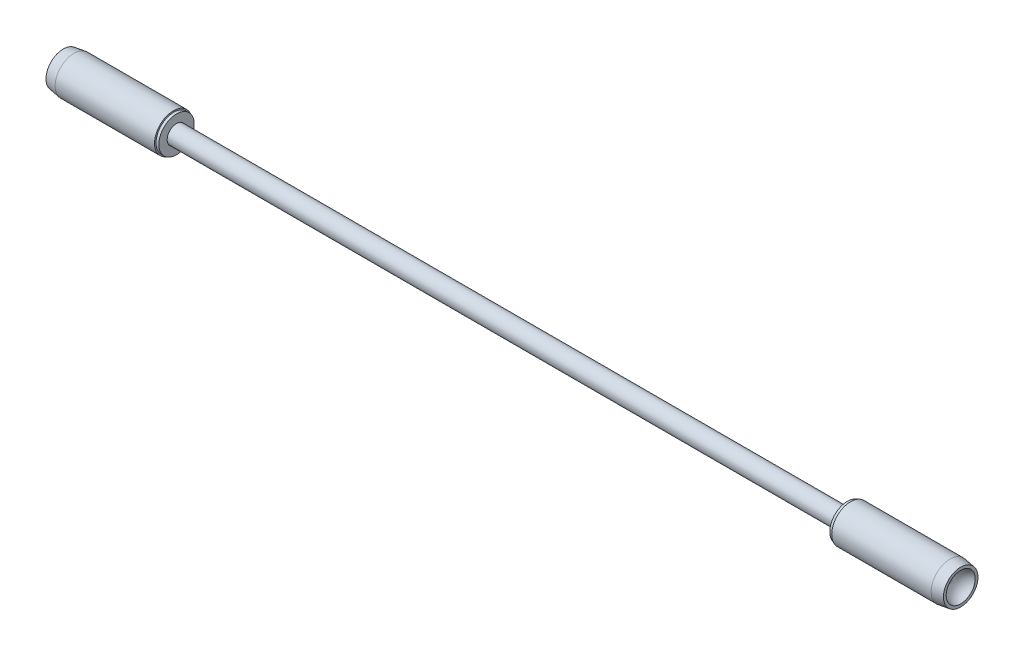
ISO-10303-21;
HEADER;
FILE_DESCRIPTION(('STEP AP214'),'2;1');
FILE_NAME('part.step','',(''),(''),'','','');
FILE_SCHEMA(('AUTOMOTIVE_DESIGN { 1 0 10303 214 1 1 1 1 }'));
ENDSEC;
DATA;
#1=APPLICATION_CONTEXT('core data for automotive mechanical design processes');
#2=APPLICATION_PROTOCOL_DEFINITION('international standard','automotive_design',2000,#1);
#3=PRODUCT_CONTEXT('',#1,'mechanical');
#4=PRODUCT('Part','Part','',(#3));
#5=PRODUCT_RELATED_PRODUCT_CATEGORY('part','',(#4));
#6=PRODUCT_DEFINITION_FORMATION('','',#4);
#7=PRODUCT_DEFINITION_CONTEXT('part definition',#1,'design');
#8=PRODUCT_DEFINITION('design','',#6,#7);
#9=PRODUCT_DEFINITION_SHAPE('','',#8);
#10=(LENGTH_UNIT() NAMED_UNIT(*) SI_UNIT(.MILLI.,.METRE.));
#11=(NAMED_UNIT(*) PLANE_ANGLE_UNIT() SI_UNIT($,.RADIAN.));
#12=(NAMED_UNIT(*) SI_UNIT($,.STERADIAN.) SOLID_ANGLE_UNIT());
#13=UNCERTAINTY_MEASURE_WITH_UNIT(LENGTH_MEASURE(1.E-05),#10,'distance_accuracy_value','');
#14=(GEOMETRIC_REPRESENTATION_CONTEXT(3) GLOBAL_UNCERTAINTY_ASSIGNED_CONTEXT((#13)) GLOBAL_UNIT_ASSIGNED_CONTEXT((#10,
#11,#12)) REPRESENTATION_CONTEXT('',''));
#15=CARTESIAN_POINT('',(0.,0.,0.));
#16=DIRECTION('',(0.,0.,1.));
#17=DIRECTION('',(1.,0.,0.));
#18=AXIS2_PLACEMENT_3D('',#15,#16,#17);
#19=CARTESIAN_POINT('',(124.1375,0.,0.));
#20=DIRECTION('',(1.,0.,0.));
#21=DIRECTION('',(0.,1.,0.));
#22=AXIS2_PLACEMENT_3D('',#19,#20,#21);
#23=PLANE('',#22);
#24=CARTESIAN_POINT('',(124.1375,0.,0.));
#25=DIRECTION('',(1.,0.,0.));
#26=DIRECTION('',(0.,1.,0.));
#27=AXIS2_PLACEMENT_3D('',#24,#25,#26);
#28=CIRCLE('',#27,5.);
#29=CARTESIAN_POINT('',(124.1375,4.99999999999995,0.));
#30=VERTEX_POINT('',#29);
#31=EDGE_CURVE('E52',#30,#30,#28,.T.);
#32=ORIENTED_EDGE('',*,*,#31,.F.);
#33=EDGE_LOOP('',(#32));
#34=FACE_BOUND('',#33,.T.);
#35=ADVANCED_FACE('F46',(#34),#23,.F.);
#36=CARTESIAN_POINT('',(139.1375,0.,0.));
#37=DIRECTION('',(1.,0.,0.));
#38=DIRECTION('',(0.,1.,0.));
#39=AXIS2_PLACEMENT_3D('',#36,#37,#38);
#40=PLANE('',#39);
#41=CARTESIAN_POINT('',(139.1375,0.,0.));
#42=DIRECTION('',(1.,0.,0.));
#43=DIRECTION('',(0.,1.,0.));
#44=AXIS2_PLACEMENT_3D('',#41,#42,#43);
#45=CIRCLE('',#44,5.);
#46=CARTESIAN_POINT('',(139.1375,4.99999999999995,0.));
#47=VERTEX_POINT('',#46);
#48=EDGE_CURVE('E11',#47,#47,#45,.T.);
#49=ORIENTED_EDGE('',*,*,#48,.T.);
#50=EDGE_LOOP('',(#49));
#51=FACE_BOUND('',#50,.T.);
#52=ADVANCED_FACE('F61',(#51),#40,.T.);
#53=CARTESIAN_POINT('',(124.0375,0.,0.));
#54=DIRECTION('',(1.,0.,0.));
#55=DIRECTION('',(0.,1.,0.));
#56=AXIS2_PLACEMENT_3D('',#53,#54,#55);
#57=CYLINDRICAL_SURFACE('',#56,5.);
#58=ORIENTED_EDGE('',*,*,#48,.F.);
#59=EDGE_LOOP('',(#58));
#60=FACE_BOUND('',#59,.T.);
#61=ORIENTED_EDGE('',*,*,#31,.T.);
#62=EDGE_LOOP('',(#61));
#63=FACE_BOUND('',#62,.T.);
#64=ADVANCED_FACE('F58',(#60,#63),#57,.T.);
#65=CLOSED_SHELL('',(#35,#52,#64));
#66=MANIFOLD_SOLID_BREP('B2',#65);
#67=CARTESIAN_POINT('',(139.2375,0.,0.));
#68=DIRECTION('',(1.,0.,0.));
#69=DIRECTION('',(0.,1.,0.));
#70=AXIS2_PLACEMENT_3D('',#67,#68,#69);
#71=PLANE('',#70);
#72=CARTESIAN_POINT('',(139.2375,0.,0.));
#73=DIRECTION('',(1.,0.,0.));
#74=DIRECTION('',(0.,1.,0.));
#75=AXIS2_PLACEMENT_3D('',#72,#73,#74);
#76=CIRCLE('',#75,5.1);
#77=CARTESIAN_POINT('',(139.2375,5.09999999999995,0.));
#78=VERTEX_POINT('',#77);
#79=EDGE_CURVE('E120',#78,#78,#76,.T.);
#80=ORIENTED_EDGE('',*,*,#79,.F.);
#81=EDGE_LOOP('',(#80));
#82=FACE_BOUND('',#81,.T.);
#83=CARTESIAN_POINT('',(139.2375,0.,0.));
#84=DIRECTION('',(1.,0.,0.));
#85=DIRECTION('',(0.,1.,0.));
#86=AXIS2_PLACEMENT_3D('',#83,#84,#85);
#87=CIRCLE('',#86,0.691917625154859);
#88=CARTESIAN_POINT('',(139.2375,0.691917625154811,0.));
#89=VERTEX_POINT('',#88);
#90=EDGE_CURVE('E45',#89,#89,#87,.T.);
#91=ORIENTED_EDGE('',*,*,#90,.T.);
#92=EDGE_LOOP('',(#91));
#93=FACE_BOUND('',#92,.T.);
#94=ADVANCED_FACE('F95',(#82,#93),#71,.F.);
#95=CARTESIAN_POINT('',(144.,0.,0.));
#96=DIRECTION('',(1.,0.,0.));
#97=DIRECTION('',(0.,1.,0.));
#98=AXIS2_PLACEMENT_3D('',#95,#96,#97);
#99=SPHERICAL_SURFACE('',#98,4.8125);
#100=CARTESIAN_POINT('',(142.6375,0.,0.));
#101=DIRECTION('',(1.,0.,0.));
#102=DIRECTION('',(0.,1.,0.));
#103=AXIS2_PLACEMENT_3D('',#100,#101,#102);
#104=CIRCLE('',#103,4.61559855273398);
#105=CARTESIAN_POINT('',(142.6375,4.61559855273393,0.));
#106=VERTEX_POINT('',#105);
#107=EDGE_CURVE('E101',#106,#106,#104,.T.);
#108=ORIENTED_EDGE('',*,*,#107,.T.);
#109=EDGE_LOOP('',(#108));
#110=FACE_BOUND('',#109,.T.);
#111=ORIENTED_EDGE('',*,*,#90,.F.);
#112=EDGE_LOOP('',(#111));
#113=FACE_BOUND('',#112,.T.);
#114=ADVANCED_FACE('F127',(#110,#113),#99,.F.);
#115=CARTESIAN_POINT('',(142.6375,0.,0.));
#116=DIRECTION('',(-1.,0.,0.));
#117=DIRECTION('',(0.,-1.,0.));
#118=AXIS2_PLACEMENT_3D('',#115,#116,#117);
#119=PLANE('',#118);
#120=ORIENTED_EDGE('',*,*,#107,.F.);
#121=EDGE_LOOP('',(#120));
#122=FACE_BOUND('',#121,.T.);
#123=CARTESIAN_POINT('',(142.6375,0.,0.));
#124=DIRECTION('',(1.,0.,0.));
#125=DIRECTION('',(0.,1.,0.));
#126=AXIS2_PLACEMENT_3D('',#123,#124,#125);
#127=CIRCLE('',#126,5.5);
#128=CARTESIAN_POINT('',(142.6375,5.49999999999995,0.));
#129=VERTEX_POINT('',#128);
#130=EDGE_CURVE('E105',#129,#129,#127,.T.);
#131=ORIENTED_EDGE('',*,*,#130,.T.);
#132=EDGE_LOOP('',(#131));
#133=FACE_BOUND('',#132,.T.);
#134=ADVANCED_FACE('F131',(#122,#133),#119,.F.);
#135=CARTESIAN_POINT('',(139.2375,0.,0.));
#136=DIRECTION('',(-1.,0.,0.));
#137=DIRECTION('',(0.,-1.,0.));
#138=AXIS2_PLACEMENT_3D('',#135,#136,#137);
#139=CONICAL_SURFACE('',#138,5.99999999999999,0.146012257711274);
#140=ORIENTED_EDGE('',*,*,#130,.F.);
#141=EDGE_LOOP('',(#140));
#142=FACE_BOUND('',#141,.T.);
#143=CARTESIAN_POINT('',(139.2375,0.,0.));
#144=DIRECTION('',(1.,0.,0.));
#145=DIRECTION('',(0.,1.,0.));
#146=AXIS2_PLACEMENT_3D('',#143,#144,#145);
#147=CIRCLE('',#146,5.99999999999999);
#148=CARTESIAN_POINT('',(139.2375,5.99999999999995,0.));
#149=VERTEX_POINT('',#148);
#150=EDGE_CURVE('E109',#149,#149,#147,.T.);
#151=ORIENTED_EDGE('',*,*,#150,.T.);
#152=EDGE_LOOP('',(#151));
#153=FACE_BOUND('',#152,.T.);
#154=ADVANCED_FACE('F135',(#142,#153),#139,.T.);
#155=CARTESIAN_POINT('',(124.0375,0.,0.));
#156=DIRECTION('',(1.,0.,0.));
#157=DIRECTION('',(0.,1.,0.));
#158=AXIS2_PLACEMENT_3D('',#155,#156,#157);
#159=CYLINDRICAL_SURFACE('',#158,6.);
#160=CARTESIAN_POINT('',(107.6375,0.,0.));
#161=DIRECTION('',(1.,0.,0.));
#162=DIRECTION('',(0.,1.,0.));
#163=AXIS2_PLACEMENT_3D('',#160,#161,#162);
#164=CIRCLE('',#163,6.);
#165=CARTESIAN_POINT('',(107.6375,5.99999999999996,0.));
#166=VERTEX_POINT('',#165);
#167=EDGE_CURVE('E114',#166,#166,#164,.T.);
#168=ORIENTED_EDGE('',*,*,#167,.T.);
#169=EDGE_LOOP('',(#168));
#170=FACE_BOUND('',#169,.T.);
#171=ORIENTED_EDGE('',*,*,#150,.F.);
#172=EDGE_LOOP('',(#171));
#173=FACE_BOUND('',#172,.T.);
#174=ADVANCED_FACE('F142',(#170,#173),#159,.T.);
#175=CARTESIAN_POINT('',(107.6375,0.,0.));
#176=DIRECTION('',(-1.,0.,0.));
#177=DIRECTION('',(0.,-1.,0.));
#178=AXIS2_PLACEMENT_3D('',#175,#176,#177);
#179=PLANE('',#178);
#180=CARTESIAN_POINT('',(107.6375,0.,0.));
#181=DIRECTION('',(1.,0.,0.));
#182=DIRECTION('',(0.,1.,0.));
#183=AXIS2_PLACEMENT_3D('',#180,#181,#182);
#184=CIRCLE('',#183,5.1);
#185=CARTESIAN_POINT('',(107.6375,5.09999999999996,0.));
#186=VERTEX_POINT('',#185);
#187=EDGE_CURVE('E117',#186,#186,#184,.T.);
#188=ORIENTED_EDGE('',*,*,#187,.T.);
#189=EDGE_LOOP('',(#188));
#190=FACE_BOUND('',#189,.T.);
#191=ORIENTED_EDGE('',*,*,#167,.F.);
#192=EDGE_LOOP('',(#191));
#193=FACE_BOUND('',#192,.T.);
#194=ADVANCED_FACE('F146',(#190,#193),#179,.T.);
#195=CARTESIAN_POINT('',(124.0375,0.,0.));
#196=DIRECTION('',(1.,0.,0.));
#197=DIRECTION('',(0.,1.,0.));
#198=AXIS2_PLACEMENT_3D('',#195,#196,#197);
#199=CYLINDRICAL_SURFACE('',#198,5.1);
#200=ORIENTED_EDGE('',*,*,#187,.F.);
#201=EDGE_LOOP('',(#200));
#202=FACE_BOUND('',#201,.T.);
#203=ORIENTED_EDGE('',*,*,#79,.T.);
#204=EDGE_LOOP('',(#203));
#205=FACE_BOUND('',#204,.T.);
#206=ADVANCED_FACE('F124',(#202,#205),#199,.F.);
#207=CLOSED_SHELL('',(#94,#114,#134,#154,#174,#194,#206));
#208=MANIFOLD_SOLID_BREP('B6',#207);
#209=CARTESIAN_POINT('',(106.6375,0.,0.));
#210=DIRECTION('',(1.,0.,0.));
#211=DIRECTION('',(0.,1.,0.));
#212=AXIS2_PLACEMENT_3D('',#209,#210,#211);
#213=PLANE('',#212);
#214=CARTESIAN_POINT('',(106.6375,0.,0.));
#215=DIRECTION('',(1.,0.,0.));
#216=DIRECTION('',(0.,1.,0.));
#217=AXIS2_PLACEMENT_3D('',#214,#215,#216);
#218=CIRCLE('',#217,5.62500000000001);
#219=CARTESIAN_POINT('',(106.6375,5.62499999999996,0.));
#220=VERTEX_POINT('',#219);
#221=EDGE_CURVE('E232',#220,#220,#218,.T.);
#222=ORIENTED_EDGE('',*,*,#221,.F.);
#223=EDGE_LOOP('',(#222));
#224=FACE_BOUND('',#223,.T.);
#225=CARTESIAN_POINT('',(106.6375,0.,0.));
#226=DIRECTION('',(1.,0.,0.));
#227=DIRECTION('',(0.,1.,0.));
#228=AXIS2_PLACEMENT_3D('',#225,#226,#227);
#229=CIRCLE('',#228,2.98);
#230=CARTESIAN_POINT('',(106.6375,2.97999999999996,0.));
#231=VERTEX_POINT('',#230);
#232=EDGE_CURVE('E94',#231,#231,#229,.T.);
#233=ORIENTED_EDGE('',*,*,#232,.T.);
#234=EDGE_LOOP('',(#233));
#235=FACE_BOUND('',#234,.T.);
#236=ADVANCED_FACE('F210',(#224,#235),#213,.F.);
#237=CARTESIAN_POINT('',(124.0375,0.,0.));
#238=DIRECTION('',(1.,0.,0.));
#239=DIRECTION('',(0.,1.,0.));
#240=AXIS2_PLACEMENT_3D('',#237,#238,#239);
#241=CYLINDRICAL_SURFACE('',#240,2.98);
#242=ORIENTED_EDGE('',*,*,#232,.F.);
#243=EDGE_LOOP('',(#242));
#244=FACE_BOUND('',#243,.T.);
#245=CARTESIAN_POINT('',(124.0375,0.,0.));
#246=DIRECTION('',(1.,0.,0.));
#247=DIRECTION('',(0.,1.,0.));
#248=AXIS2_PLACEMENT_3D('',#245,#246,#247);
#249=CIRCLE('',#248,2.98);
#250=CARTESIAN_POINT('',(124.0375,2.97999999999996,0.));
#251=VERTEX_POINT('',#250);
#252=EDGE_CURVE('E216',#251,#251,#249,.T.);
#253=ORIENTED_EDGE('',*,*,#252,.T.);
#254=EDGE_LOOP('',(#253));
#255=FACE_BOUND('',#254,.T.);
#256=ADVANCED_FACE('F239',(#244,#255),#241,.F.);
#257=CARTESIAN_POINT('',(124.0375,0.,0.));
#258=DIRECTION('',(-1.,0.,0.));
#259=DIRECTION('',(0.,-1.,0.));
#260=AXIS2_PLACEMENT_3D('',#257,#258,#259);
#261=PLANE('',#260);
#262=ORIENTED_EDGE('',*,*,#252,.F.);
#263=EDGE_LOOP('',(#262));
#264=FACE_BOUND('',#263,.T.);
#265=CARTESIAN_POINT('',(124.0375,0.,0.));
#266=DIRECTION('',(1.,0.,0.));
#267=DIRECTION('',(0.,1.,0.));
#268=AXIS2_PLACEMENT_3D('',#265,#266,#267);
#269=CIRCLE('',#268,5.);
#270=CARTESIAN_POINT('',(124.0375,4.99999999999995,0.));
#271=VERTEX_POINT('',#270);
#272=EDGE_CURVE('E220',#271,#271,#269,.T.);
#273=ORIENTED_EDGE('',*,*,#272,.T.);
#274=EDGE_LOOP('',(#273));
#275=FACE_BOUND('',#274,.T.);
#276=ADVANCED_FACE('F243',(#264,#275),#261,.F.);
#277=CARTESIAN_POINT('',(124.0375,0.,0.));
#278=DIRECTION('',(1.,0.,0.));
#279=DIRECTION('',(0.,1.,0.));
#280=AXIS2_PLACEMENT_3D('',#277,#278,#279);
#281=CYLINDRICAL_SURFACE('',#280,5.);
#282=ORIENTED_EDGE('',*,*,#272,.F.);
#283=EDGE_LOOP('',(#282));
#284=FACE_BOUND('',#283,.T.);
#285=CARTESIAN_POINT('',(107.5375,0.,0.));
#286=DIRECTION('',(1.,0.,0.));
#287=DIRECTION('',(0.,1.,0.));
#288=AXIS2_PLACEMENT_3D('',#285,#286,#287);
#289=CIRCLE('',#288,5.00000000000001);
#290=CARTESIAN_POINT('',(107.5375,4.99999999999996,0.));
#291=VERTEX_POINT('',#290);
#292=EDGE_CURVE('E224',#291,#291,#289,.T.);
#293=ORIENTED_EDGE('',*,*,#292,.T.);
#294=EDGE_LOOP('',(#293));
#295=FACE_BOUND('',#294,.T.);
#296=ADVANCED_FACE('F248',(#284,#295),#281,.T.);
#297=CARTESIAN_POINT('',(107.5375,0.,0.));
#298=DIRECTION('',(-1.,0.,0.));
#299=DIRECTION('',(0.,-1.,0.));
#300=AXIS2_PLACEMENT_3D('',#297,#298,#299);
#301=PLANE('',#300);
#302=ORIENTED_EDGE('',*,*,#292,.F.);
#303=EDGE_LOOP('',(#302));
#304=FACE_BOUND('',#303,.T.);
#305=CARTESIAN_POINT('',(107.5375,0.,0.));
#306=DIRECTION('',(1.,0.,0.));
#307=DIRECTION('',(0.,1.,0.));
#308=AXIS2_PLACEMENT_3D('',#305,#306,#307);
#309=CIRCLE('',#308,5.62500000000001);
#310=CARTESIAN_POINT('',(107.5375,5.62499999999996,0.));
#311=VERTEX_POINT('',#310);
#312=EDGE_CURVE('E229',#311,#311,#309,.T.);
#313=ORIENTED_EDGE('',*,*,#312,.T.);
#314=EDGE_LOOP('',(#313));
#315=FACE_BOUND('',#314,.T.);
#316=ADVANCED_FACE('F254',(#304,#315),#301,.F.);
#317=CARTESIAN_POINT('',(124.0375,0.,0.));
#318=DIRECTION('',(1.,0.,0.));
#319=DIRECTION('',(0.,1.,0.));
#320=AXIS2_PLACEMENT_3D('',#317,#318,#319);
#321=CYLINDRICAL_SURFACE('',#320,5.625);
#322=ORIENTED_EDGE('',*,*,#312,.F.);
#323=EDGE_LOOP('',(#322));
#324=FACE_BOUND('',#323,.T.);
#325=ORIENTED_EDGE('',*,*,#221,.T.);
#326=EDGE_LOOP('',(#325));
#327=FACE_BOUND('',#326,.T.);
#328=ADVANCED_FACE('F236',(#324,#327),#321,.T.);
#329=CLOSED_SHELL('',(#236,#256,#276,#296,#316,#328));
#330=MANIFOLD_SOLID_BREP('B40',#329);
#331=CARTESIAN_POINT('',(124.0375,0.,0.));
#332=DIRECTION('',(1.,0.,0.));
#333=DIRECTION('',(0.,1.,0.));
#334=AXIS2_PLACEMENT_3D('',#331,#332,#333);
#335=PLANE('',#334);
#336=CARTESIAN_POINT('',(124.0375,0.,0.));
#337=DIRECTION('',(1.,0.,0.));
#338=DIRECTION('',(0.,1.,0.));
#339=AXIS2_PLACEMENT_3D('',#336,#337,#338);
#340=CIRCLE('',#339,2.93);
#341=CARTESIAN_POINT('',(124.0375,2.92999999999995,0.));
#342=VERTEX_POINT('',#341);
#343=EDGE_CURVE('E209',#342,#342,#340,.T.);
#344=ORIENTED_EDGE('',*,*,#343,.T.);
#345=EDGE_LOOP('',(#344));
#346=FACE_BOUND('',#345,.T.);
#347=ADVANCED_FACE('F310',(#346),#335,.T.);
#348=CARTESIAN_POINT('',(124.0375,0.,0.));
#349=DIRECTION('',(1.,0.,0.));
#350=DIRECTION('',(0.,1.,0.));
#351=AXIS2_PLACEMENT_3D('',#348,#349,#350);
#352=CYLINDRICAL_SURFACE('',#351,2.93);
#353=ORIENTED_EDGE('',*,*,#343,.F.);
#354=EDGE_LOOP('',(#353));
#355=FACE_BOUND('',#354,.T.);
#356=CARTESIAN_POINT('',(-124.0375,0.,0.));
#357=DIRECTION('',(1.,0.,0.));
#358=DIRECTION('',(0.,1.,0.));
#359=AXIS2_PLACEMENT_3D('',#356,#357,#358);
#360=CIRCLE('',#359,2.93);
#361=CARTESIAN_POINT('',(-124.0375,2.92999999999999,0.));
#362=VERTEX_POINT('',#361);
#363=EDGE_CURVE('E316',#362,#362,#360,.T.);
#364=ORIENTED_EDGE('',*,*,#363,.T.);
#365=EDGE_LOOP('',(#364));
#366=FACE_BOUND('',#365,.T.);
#367=ADVANCED_FACE('F322',(#355,#366),#352,.T.);
#368=CARTESIAN_POINT('',(-124.0375,0.,0.));
#369=DIRECTION('',(1.,0.,0.));
#370=DIRECTION('',(0.,1.,0.));
#371=AXIS2_PLACEMENT_3D('',#368,#369,#370);
#372=PLANE('',#371);
#373=ORIENTED_EDGE('',*,*,#363,.F.);
#374=EDGE_LOOP('',(#373));
#375=FACE_BOUND('',#374,.T.);
#376=ADVANCED_FACE('F324',(#375),#372,.F.);
#377=CLOSED_SHELL('',(#347,#367,#376));
#378=MANIFOLD_SOLID_BREP('B89',#377);
#379=CARTESIAN_POINT('',(-124.0375,0.,0.));
#380=DIRECTION('',(-1.,0.,0.));
#381=DIRECTION('',(0.,-1.,0.));
#382=AXIS2_PLACEMENT_3D('',#379,#380,#381);
#383=PLANE('',#382);
#384=CARTESIAN_POINT('',(-124.0375,0.,0.));
#385=DIRECTION('',(1.,0.,0.));
#386=DIRECTION('',(0.,1.,0.));
#387=AXIS2_PLACEMENT_3D('',#384,#385,#386);
#388=CIRCLE('',#387,2.98);
#389=CARTESIAN_POINT('',(-124.0375,2.97999999999999,0.));
#390=VERTEX_POINT('',#389);
#391=EDGE_CURVE('E309',#390,#390,#388,.T.);
#392=ORIENTED_EDGE('',*,*,#391,.T.);
#393=EDGE_LOOP('',(#392));
#394=FACE_BOUND('',#393,.T.);
#395=CARTESIAN_POINT('',(-124.0375,0.,0.));
#396=DIRECTION('',(1.,0.,0.));
#397=DIRECTION('',(0.,1.,0.));
#398=AXIS2_PLACEMENT_3D('',#395,#396,#397);
#399=CIRCLE('',#398,5.);
#400=CARTESIAN_POINT('',(-124.0375,4.99999999999999,0.));
#401=VERTEX_POINT('',#400);
#402=EDGE_CURVE('E381',#401,#401,#399,.T.);
#403=ORIENTED_EDGE('',*,*,#402,.F.);
#404=EDGE_LOOP('',(#403));
#405=FACE_BOUND('',#404,.T.);
#406=ADVANCED_FACE('F359',(#394,#405),#383,.T.);
#407=CARTESIAN_POINT('',(124.0375,0.,0.));
#408=DIRECTION('',(1.,0.,0.));
#409=DIRECTION('',(0.,1.,0.));
#410=AXIS2_PLACEMENT_3D('',#407,#408,#409);
#411=CYLINDRICAL_SURFACE('',#410,2.98);
#412=CARTESIAN_POINT('',(-106.6375,0.,0.));
#413=DIRECTION('',(1.,0.,0.));
#414=DIRECTION('',(0.,1.,0.));
#415=AXIS2_PLACEMENT_3D('',#412,#413,#414);
#416=CIRCLE('',#415,2.98);
#417=CARTESIAN_POINT('',(-106.6375,2.97999999999999,0.));
#418=VERTEX_POINT('',#417);
#419=EDGE_CURVE('E365',#418,#418,#416,.T.);
#420=ORIENTED_EDGE('',*,*,#419,.T.);
#421=EDGE_LOOP('',(#420));
#422=FACE_BOUND('',#421,.T.);
#423=ORIENTED_EDGE('',*,*,#391,.F.);
#424=EDGE_LOOP('',(#423));
#425=FACE_BOUND('',#424,.T.);
#426=ADVANCED_FACE('F389',(#422,#425),#411,.F.);
#427=CARTESIAN_POINT('',(-106.6375,0.,0.));
#428=DIRECTION('',(1.,0.,0.));
#429=DIRECTION('',(0.,1.,0.));
#430=AXIS2_PLACEMENT_3D('',#427,#428,#429);
#431=PLANE('',#430);
#432=CARTESIAN_POINT('',(-106.6375,0.,0.));
#433=DIRECTION('',(1.,0.,0.));
#434=DIRECTION('',(0.,1.,0.));
#435=AXIS2_PLACEMENT_3D('',#432,#433,#434);
#436=CIRCLE('',#435,5.625);
#437=CARTESIAN_POINT('',(-106.6375,5.62499999999999,0.));
#438=VERTEX_POINT('',#437);
#439=EDGE_CURVE('E369',#438,#438,#436,.T.);
#440=ORIENTED_EDGE('',*,*,#439,.T.);
#441=EDGE_LOOP('',(#440));
#442=FACE_BOUND('',#441,.T.);
#443=ORIENTED_EDGE('',*,*,#419,.F.);
#444=EDGE_LOOP('',(#443));
#445=FACE_BOUND('',#444,.T.);
#446=ADVANCED_FACE('F393',(#442,#445),#431,.T.);
#447=CARTESIAN_POINT('',(124.0375,0.,0.));
#448=DIRECTION('',(1.,0.,0.));
#449=DIRECTION('',(0.,1.,0.));
#450=AXIS2_PLACEMENT_3D('',#447,#448,#449);
#451=CYLINDRICAL_SURFACE('',#450,5.625);
#452=CARTESIAN_POINT('',(-107.5375,0.,0.));
#453=DIRECTION('',(1.,0.,0.));
#454=DIRECTION('',(0.,1.,0.));
#455=AXIS2_PLACEMENT_3D('',#452,#453,#454);
#456=CIRCLE('',#455,5.625);
#457=CARTESIAN_POINT('',(-107.5375,5.62499999999999,0.));
#458=VERTEX_POINT('',#457);
#459=EDGE_CURVE('E373',#458,#458,#456,.T.);
#460=ORIENTED_EDGE('',*,*,#459,.T.);
#461=EDGE_LOOP('',(#460));
#462=FACE_BOUND('',#461,.T.);
#463=ORIENTED_EDGE('',*,*,#439,.F.);
#464=EDGE_LOOP('',(#463));
#465=FACE_BOUND('',#464,.T.);
#466=ADVANCED_FACE('F397',(#462,#465),#451,.T.);
#467=CARTESIAN_POINT('',(-107.5375,0.,0.));
#468=DIRECTION('',(-1.,0.,0.));
#469=DIRECTION('',(0.,-1.,0.));
#470=AXIS2_PLACEMENT_3D('',#467,#468,#469);
#471=PLANE('',#470);
#472=CARTESIAN_POINT('',(-107.5375,0.,0.));
#473=DIRECTION('',(1.,0.,0.));
#474=DIRECTION('',(0.,1.,0.));
#475=AXIS2_PLACEMENT_3D('',#472,#473,#474);
#476=CIRCLE('',#475,5.);
#477=CARTESIAN_POINT('',(-107.5375,4.99999999999999,0.));
#478=VERTEX_POINT('',#477);
#479=EDGE_CURVE('E378',#478,#478,#476,.T.);
#480=ORIENTED_EDGE('',*,*,#479,.T.);
#481=EDGE_LOOP('',(#480));
#482=FACE_BOUND('',#481,.T.);
#483=ORIENTED_EDGE('',*,*,#459,.F.);
#484=EDGE_LOOP('',(#483));
#485=FACE_BOUND('',#484,.T.);
#486=ADVANCED_FACE('F404',(#482,#485),#471,.T.);
#487=CARTESIAN_POINT('',(124.0375,0.,0.));
#488=DIRECTION('',(1.,0.,0.));
#489=DIRECTION('',(0.,1.,0.));
#490=AXIS2_PLACEMENT_3D('',#487,#488,#489);
#491=CYLINDRICAL_SURFACE('',#490,5.);
#492=ORIENTED_EDGE('',*,*,#402,.T.);
#493=EDGE_LOOP('',(#492));
#494=FACE_BOUND('',#493,.T.);
#495=ORIENTED_EDGE('',*,*,#479,.F.);
#496=EDGE_LOOP('',(#495));
#497=FACE_BOUND('',#496,.T.);
#498=ADVANCED_FACE('F385',(#494,#497),#491,.T.);
#499=CLOSED_SHELL('',(#406,#426,#446,#466,#486,#498));
#500=MANIFOLD_SOLID_BREP('B204',#499);
#501=CARTESIAN_POINT('',(-139.1375,0.,0.));
#502=DIRECTION('',(1.,0.,0.));
#503=DIRECTION('',(0.,1.,0.));
#504=AXIS2_PLACEMENT_3D('',#501,#502,#503);
#505=PLANE('',#504);
#506=CARTESIAN_POINT('',(-139.1375,0.,0.));
#507=DIRECTION('',(1.,0.,0.));
#508=DIRECTION('',(0.,1.,0.));
#509=AXIS2_PLACEMENT_3D('',#506,#507,#508);
#510=CIRCLE('',#509,5.);
#511=CARTESIAN_POINT('',(-139.1375,4.99999999999998,0.));
#512=VERTEX_POINT('',#511);
#513=EDGE_CURVE('E464',#512,#512,#510,.T.);
#514=ORIENTED_EDGE('',*,*,#513,.F.);
#515=EDGE_LOOP('',(#514));
#516=FACE_BOUND('',#515,.T.);
#517=ADVANCED_FACE('F458',(#516),#505,.F.);
#518=CARTESIAN_POINT('',(-124.1375,0.,0.));
#519=DIRECTION('',(1.,0.,0.));
#520=DIRECTION('',(0.,1.,0.));
#521=AXIS2_PLACEMENT_3D('',#518,#519,#520);
#522=PLANE('',#521);
#523=CARTESIAN_POINT('',(-124.1375,0.,0.));
#524=DIRECTION('',(1.,0.,0.));
#525=DIRECTION('',(0.,1.,0.));
#526=AXIS2_PLACEMENT_3D('',#523,#524,#525);
#527=CIRCLE('',#526,5.);
#528=CARTESIAN_POINT('',(-124.1375,4.99999999999999,0.));
#529=VERTEX_POINT('',#528);
#530=EDGE_CURVE('E358',#529,#529,#527,.T.);
#531=ORIENTED_EDGE('',*,*,#530,.T.);
#532=EDGE_LOOP('',(#531));
#533=FACE_BOUND('',#532,.T.);
#534=ADVANCED_FACE('F474',(#533),#522,.T.);
#535=CARTESIAN_POINT('',(124.0375,0.,0.));
#536=DIRECTION('',(1.,0.,0.));
#537=DIRECTION('',(0.,1.,0.));
#538=AXIS2_PLACEMENT_3D('',#535,#536,#537);
#539=CYLINDRICAL_SURFACE('',#538,5.);
#540=ORIENTED_EDGE('',*,*,#513,.T.);
#541=EDGE_LOOP('',(#540));
#542=FACE_BOUND('',#541,.T.);
#543=ORIENTED_EDGE('',*,*,#530,.F.);
#544=EDGE_LOOP('',(#543));
#545=FACE_BOUND('',#544,.T.);
#546=ADVANCED_FACE('F470',(#542,#545),#539,.T.);
#547=CLOSED_SHELL('',(#517,#534,#546));
#548=MANIFOLD_SOLID_BREP('B304',#547);
#549=CARTESIAN_POINT('',(-144.,0.,0.));
#550=DIRECTION('',(1.,0.,0.));
#551=DIRECTION('',(0.,1.,0.));
#552=AXIS2_PLACEMENT_3D('',#549,#550,#551);
#553=SPHERICAL_SURFACE('',#552,4.8125);
#554=CARTESIAN_POINT('',(-142.6375,0.,0.));
#555=DIRECTION('',(1.,0.,0.));
#556=DIRECTION('',(0.,1.,0.));
#557=AXIS2_PLACEMENT_3D('',#554,#555,#556);
#558=CIRCLE('',#557,4.61559855273398);
#559=CARTESIAN_POINT('',(-142.6375,4.61559855273396,0.));
#560=VERTEX_POINT('',#559);
#561=EDGE_CURVE('E524',#560,#560,#558,.T.);
#562=ORIENTED_EDGE('',*,*,#561,.F.);
#563=EDGE_LOOP('',(#562));
#564=FACE_BOUND('',#563,.T.);
#565=CARTESIAN_POINT('',(-139.2375,0.,0.));
#566=DIRECTION('',(1.,0.,0.));
#567=DIRECTION('',(0.,1.,0.));
#568=AXIS2_PLACEMENT_3D('',#565,#566,#567);
#569=CIRCLE('',#568,0.691917625154858);
#570=CARTESIAN_POINT('',(-139.2375,0.691917625154845,0.));
#571=VERTEX_POINT('',#570);
#572=EDGE_CURVE('E457',#571,#571,#569,.T.);
#573=ORIENTED_EDGE('',*,*,#572,.T.);
#574=EDGE_LOOP('',(#573));
#575=FACE_BOUND('',#574,.T.);
#576=ADVANCED_FACE('F499',(#564,#575),#553,.F.);
#577=CARTESIAN_POINT('',(-139.2375,0.,0.));
#578=DIRECTION('',(1.,0.,0.));
#579=DIRECTION('',(0.,1.,0.));
#580=AXIS2_PLACEMENT_3D('',#577,#578,#579);
#581=PLANE('',#580);
#582=CARTESIAN_POINT('',(-139.2375,0.,0.));
#583=DIRECTION('',(1.,0.,0.));
#584=DIRECTION('',(0.,1.,0.));
#585=AXIS2_PLACEMENT_3D('',#582,#583,#584);
#586=CIRCLE('',#585,5.1);
#587=CARTESIAN_POINT('',(-139.2375,5.09999999999998,0.));
#588=VERTEX_POINT('',#587);
#589=EDGE_CURVE('E505',#588,#588,#586,.T.);
#590=ORIENTED_EDGE('',*,*,#589,.T.);
#591=EDGE_LOOP('',(#590));
#592=FACE_BOUND('',#591,.T.);
#593=ORIENTED_EDGE('',*,*,#572,.F.);
#594=EDGE_LOOP('',(#593));
#595=FACE_BOUND('',#594,.T.);
#596=ADVANCED_FACE('F532',(#592,#595),#581,.T.);
#597=CARTESIAN_POINT('',(124.0375,0.,0.));
#598=DIRECTION('',(1.,0.,0.));
#599=DIRECTION('',(0.,1.,0.));
#600=AXIS2_PLACEMENT_3D('',#597,#598,#599);
#601=CYLINDRICAL_SURFACE('',#600,5.1);
#602=CARTESIAN_POINT('',(-107.6375,0.,0.));
#603=DIRECTION('',(1.,0.,0.));
#604=DIRECTION('',(0.,1.,0.));
#605=AXIS2_PLACEMENT_3D('',#602,#603,#604);
#606=CIRCLE('',#605,5.1);
#607=CARTESIAN_POINT('',(-107.6375,5.09999999999998,0.));
#608=VERTEX_POINT('',#607);
#609=EDGE_CURVE('E509',#608,#608,#606,.T.);
#610=ORIENTED_EDGE('',*,*,#609,.T.);
#611=EDGE_LOOP('',(#610));
#612=FACE_BOUND('',#611,.T.);
#613=ORIENTED_EDGE('',*,*,#589,.F.);
#614=EDGE_LOOP('',(#613));
#615=FACE_BOUND('',#614,.T.);
#616=ADVANCED_FACE('F536',(#612,#615),#601,.F.);
#617=CARTESIAN_POINT('',(-107.6375,0.,0.));
#618=DIRECTION('',(-1.,0.,0.));
#619=DIRECTION('',(0.,-1.,0.));
#620=AXIS2_PLACEMENT_3D('',#617,#618,#619);
#621=PLANE('',#620);
#622=ORIENTED_EDGE('',*,*,#609,.F.);
#623=EDGE_LOOP('',(#622));
#624=FACE_BOUND('',#623,.T.);
#625=CARTESIAN_POINT('',(-107.6375,0.,0.));
#626=DIRECTION('',(1.,0.,0.));
#627=DIRECTION('',(0.,1.,0.));
#628=AXIS2_PLACEMENT_3D('',#625,#626,#627);
#629=CIRCLE('',#628,6.);
#630=CARTESIAN_POINT('',(-107.6375,5.99999999999998,0.));
#631=VERTEX_POINT('',#630);
#632=EDGE_CURVE('E513',#631,#631,#629,.T.);
#633=ORIENTED_EDGE('',*,*,#632,.T.);
#634=EDGE_LOOP('',(#633));
#635=FACE_BOUND('',#634,.T.);
#636=ADVANCED_FACE('F540',(#624,#635),#621,.F.);
#637=CARTESIAN_POINT('',(124.0375,0.,0.));
#638=DIRECTION('',(1.,0.,0.));
#639=DIRECTION('',(0.,1.,0.));
#640=AXIS2_PLACEMENT_3D('',#637,#638,#639);
#641=CYLINDRICAL_SURFACE('',#640,6.);
#642=ORIENTED_EDGE('',*,*,#632,.F.);
#643=EDGE_LOOP('',(#642));
#644=FACE_BOUND('',#643,.T.);
#645=CARTESIAN_POINT('',(-139.2375,0.,0.));
#646=DIRECTION('',(1.,0.,0.));
#647=DIRECTION('',(0.,1.,0.));
#648=AXIS2_PLACEMENT_3D('',#645,#646,#647);
#649=CIRCLE('',#648,6.);
#650=CARTESIAN_POINT('',(-139.2375,5.99999999999998,0.));
#651=VERTEX_POINT('',#650);
#652=EDGE_CURVE('E518',#651,#651,#649,.T.);
#653=ORIENTED_EDGE('',*,*,#652,.T.);
#654=EDGE_LOOP('',(#653));
#655=FACE_BOUND('',#654,.T.);
#656=ADVANCED_FACE('F547',(#644,#655),#641,.T.);
#657=CARTESIAN_POINT('',(-139.2375,0.,0.));
#658=DIRECTION('',(1.,0.,0.));
#659=DIRECTION('',(0.,1.,0.));
#660=AXIS2_PLACEMENT_3D('',#657,#658,#659);
#661=CONICAL_SURFACE('',#660,6.,0.146012257711275);
#662=CARTESIAN_POINT('',(-142.6375,0.,0.));
#663=DIRECTION('',(1.,0.,0.));
#664=DIRECTION('',(0.,1.,0.));
#665=AXIS2_PLACEMENT_3D('',#662,#663,#664);
#666=CIRCLE('',#665,5.49999999999999);
#667=CARTESIAN_POINT('',(-142.6375,5.49999999999998,0.));
#668=VERTEX_POINT('',#667);
#669=EDGE_CURVE('E521',#668,#668,#666,.T.);
#670=ORIENTED_EDGE('',*,*,#669,.T.);
#671=EDGE_LOOP('',(#670));
#672=FACE_BOUND('',#671,.T.);
#673=ORIENTED_EDGE('',*,*,#652,.F.);
#674=EDGE_LOOP('',(#673));
#675=FACE_BOUND('',#674,.T.);
#676=ADVANCED_FACE('F551',(#672,#675),#661,.T.);
#677=CARTESIAN_POINT('',(-142.6375,0.,0.));
#678=DIRECTION('',(-1.,0.,0.));
#679=DIRECTION('',(0.,-1.,0.));
#680=AXIS2_PLACEMENT_3D('',#677,#678,#679);
#681=PLANE('',#680);
#682=ORIENTED_EDGE('',*,*,#561,.T.);
#683=EDGE_LOOP('',(#682));
#684=FACE_BOUND('',#683,.T.);
#685=ORIENTED_EDGE('',*,*,#669,.F.);
#686=EDGE_LOOP('',(#685));
#687=FACE_BOUND('',#686,.T.);
#688=ADVANCED_FACE('F528',(#684,#687),#681,.T.);
#689=CLOSED_SHELL('',(#576,#596,#616,#636,#656,#676,#688));
#690=MANIFOLD_SOLID_BREP('B353',#689);
#691=ADVANCED_BREP_SHAPE_REPRESENTATION('',(#18,#66,#208,#330,#378,#500,#548,#690),#14);
#692=SHAPE_DEFINITION_REPRESENTATION(#9,#691);
ENDSEC;
END-ISO-10303-21;
